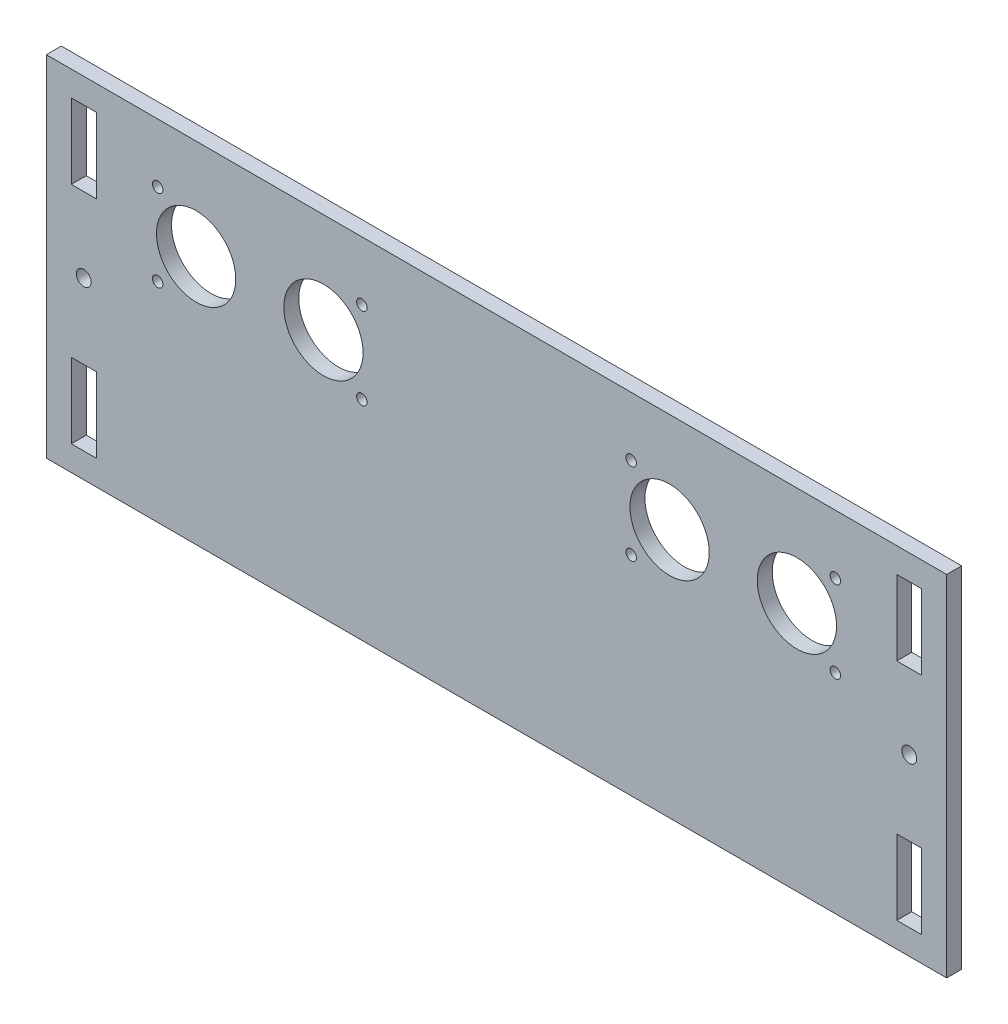
ISO-10303-21;
HEADER;
FILE_DESCRIPTION(('STEP AP214'),'2;1');
FILE_NAME('part.step','',(''),(''),'','','');
FILE_SCHEMA(('AUTOMOTIVE_DESIGN { 1 0 10303 214 1 1 1 1 }'));
ENDSEC;
DATA;
#1=APPLICATION_CONTEXT('core data for automotive mechanical design processes');
#2=APPLICATION_PROTOCOL_DEFINITION('international standard','automotive_design',2000,#1);
#3=PRODUCT_CONTEXT('',#1,'mechanical');
#4=PRODUCT('Part','Part','',(#3));
#5=PRODUCT_RELATED_PRODUCT_CATEGORY('part','',(#4));
#6=PRODUCT_DEFINITION_FORMATION('','',#4);
#7=PRODUCT_DEFINITION_CONTEXT('part definition',#1,'design');
#8=PRODUCT_DEFINITION('design','',#6,#7);
#9=PRODUCT_DEFINITION_SHAPE('','',#8);
#10=(LENGTH_UNIT() NAMED_UNIT(*) SI_UNIT(.MILLI.,.METRE.));
#11=(NAMED_UNIT(*) PLANE_ANGLE_UNIT() SI_UNIT($,.RADIAN.));
#12=(NAMED_UNIT(*) SI_UNIT($,.STERADIAN.) SOLID_ANGLE_UNIT());
#13=UNCERTAINTY_MEASURE_WITH_UNIT(LENGTH_MEASURE(1.E-05),#10,'distance_accuracy_value','');
#14=(GEOMETRIC_REPRESENTATION_CONTEXT(3) GLOBAL_UNCERTAINTY_ASSIGNED_CONTEXT((#13)) GLOBAL_UNIT_ASSIGNED_CONTEXT((#10,
#11,#12)) REPRESENTATION_CONTEXT('',''));
#15=CARTESIAN_POINT('',(0.,0.,0.));
#16=DIRECTION('',(0.,0.,1.));
#17=DIRECTION('',(1.,0.,0.));
#18=AXIS2_PLACEMENT_3D('',#15,#16,#17);
#19=CARTESIAN_POINT('',(0.,0.,3.));
#20=DIRECTION('',(0.,0.,1.));
#21=DIRECTION('',(1.,0.,0.));
#22=AXIS2_PLACEMENT_3D('',#19,#20,#21);
#23=PLANE('',#22);
#24=CARTESIAN_POINT('',(67.87,23.2,3.));
#25=DIRECTION('',(0.,0.,1.));
#26=DIRECTION('',(-1.,0.,0.));
#27=AXIS2_PLACEMENT_3D('',#24,#25,#26);
#28=CIRCLE('',#27,1.04999999999999);
#29=CARTESIAN_POINT('',(66.82,23.2,3.));
#30=VERTEX_POINT('',#29);
#31=EDGE_CURVE('E678',#30,#30,#28,.T.);
#32=ORIENTED_EDGE('',*,*,#31,.F.);
#33=EDGE_LOOP('',(#32));
#34=FACE_BOUND('',#33,.T.);
#35=CARTESIAN_POINT('',(67.87,6.8,3.));
#36=DIRECTION('',(0.,0.,1.));
#37=DIRECTION('',(1.,0.,0.));
#38=AXIS2_PLACEMENT_3D('',#35,#36,#37);
#39=CIRCLE('',#38,1.04999999999999);
#40=CARTESIAN_POINT('',(68.92,6.8,3.));
#41=VERTEX_POINT('',#40);
#42=EDGE_CURVE('E686',#41,#41,#39,.T.);
#43=ORIENTED_EDGE('',*,*,#42,.F.);
#44=EDGE_LOOP('',(#43));
#45=FACE_BOUND('',#44,.T.);
#46=CARTESIAN_POINT('',(26.97,6.8,3.));
#47=DIRECTION('',(0.,0.,1.));
#48=DIRECTION('',(-1.,0.,0.));
#49=AXIS2_PLACEMENT_3D('',#46,#47,#48);
#50=CIRCLE('',#49,1.05);
#51=CARTESIAN_POINT('',(25.92,6.8,3.));
#52=VERTEX_POINT('',#51);
#53=EDGE_CURVE('E692',#52,#52,#50,.T.);
#54=ORIENTED_EDGE('',*,*,#53,.F.);
#55=EDGE_LOOP('',(#54));
#56=FACE_BOUND('',#55,.T.);
#57=CARTESIAN_POINT('',(26.97,23.2,3.));
#58=DIRECTION('',(0.,0.,1.));
#59=DIRECTION('',(1.,0.,0.));
#60=AXIS2_PLACEMENT_3D('',#57,#58,#59);
#61=CIRCLE('',#60,1.05);
#62=CARTESIAN_POINT('',(28.02,23.2,3.));
#63=VERTEX_POINT('',#62);
#64=EDGE_CURVE('E698',#63,#63,#61,.T.);
#65=ORIENTED_EDGE('',*,*,#64,.F.);
#66=EDGE_LOOP('',(#65));
#67=FACE_BOUND('',#66,.T.);
#68=CARTESIAN_POINT('',(-67.87,23.2,3.));
#69=DIRECTION('',(0.,0.,1.));
#70=DIRECTION('',(1.,0.,0.));
#71=AXIS2_PLACEMENT_3D('',#68,#69,#70);
#72=CIRCLE('',#71,1.04999999999999);
#73=CARTESIAN_POINT('',(-66.82,23.2,3.));
#74=VERTEX_POINT('',#73);
#75=EDGE_CURVE('E704',#74,#74,#72,.T.);
#76=ORIENTED_EDGE('',*,*,#75,.F.);
#77=EDGE_LOOP('',(#76));
#78=FACE_BOUND('',#77,.T.);
#79=CARTESIAN_POINT('',(-67.87,6.8,3.));
#80=DIRECTION('',(0.,0.,1.));
#81=DIRECTION('',(-1.,0.,0.));
#82=AXIS2_PLACEMENT_3D('',#79,#80,#81);
#83=CIRCLE('',#82,1.04999999999999);
#84=CARTESIAN_POINT('',(-68.92,6.8,3.));
#85=VERTEX_POINT('',#84);
#86=EDGE_CURVE('E710',#85,#85,#83,.T.);
#87=ORIENTED_EDGE('',*,*,#86,.F.);
#88=EDGE_LOOP('',(#87));
#89=FACE_BOUND('',#88,.T.);
#90=CARTESIAN_POINT('',(-26.97,23.2,3.));
#91=DIRECTION('',(0.,0.,1.));
#92=DIRECTION('',(-1.,0.,0.));
#93=AXIS2_PLACEMENT_3D('',#90,#91,#92);
#94=CIRCLE('',#93,1.05);
#95=CARTESIAN_POINT('',(-28.02,23.2,3.));
#96=VERTEX_POINT('',#95);
#97=EDGE_CURVE('E716',#96,#96,#94,.T.);
#98=ORIENTED_EDGE('',*,*,#97,.F.);
#99=EDGE_LOOP('',(#98));
#100=FACE_BOUND('',#99,.T.);
#101=CARTESIAN_POINT('',(-26.97,6.8,3.));
#102=DIRECTION('',(0.,0.,1.));
#103=DIRECTION('',(1.,0.,0.));
#104=AXIS2_PLACEMENT_3D('',#101,#102,#103);
#105=CIRCLE('',#104,1.05);
#106=CARTESIAN_POINT('',(-25.92,6.8,3.));
#107=VERTEX_POINT('',#106);
#108=EDGE_CURVE('E722',#107,#107,#105,.T.);
#109=ORIENTED_EDGE('',*,*,#108,.F.);
#110=EDGE_LOOP('',(#109));
#111=FACE_BOUND('',#110,.T.);
#112=CARTESIAN_POINT('',(34.67,15.,3.));
#113=DIRECTION('',(0.,0.,1.));
#114=DIRECTION('',(-1.,0.,0.));
#115=AXIS2_PLACEMENT_3D('',#112,#113,#114);
#116=CIRCLE('',#115,7.94);
#117=CARTESIAN_POINT('',(26.73,15.,3.));
#118=VERTEX_POINT('',#117);
#119=EDGE_CURVE('E728',#118,#118,#116,.T.);
#120=ORIENTED_EDGE('',*,*,#119,.F.);
#121=EDGE_LOOP('',(#120));
#122=FACE_BOUND('',#121,.T.);
#123=CARTESIAN_POINT('',(60.17,15.,3.));
#124=DIRECTION('',(0.,0.,1.));
#125=DIRECTION('',(-1.,0.,0.));
#126=AXIS2_PLACEMENT_3D('',#123,#124,#125);
#127=CIRCLE('',#126,7.94);
#128=CARTESIAN_POINT('',(52.23,15.,3.));
#129=VERTEX_POINT('',#128);
#130=EDGE_CURVE('E734',#129,#129,#127,.T.);
#131=ORIENTED_EDGE('',*,*,#130,.F.);
#132=EDGE_LOOP('',(#131));
#133=FACE_BOUND('',#132,.T.);
#134=CARTESIAN_POINT('',(-34.67,15.,3.));
#135=DIRECTION('',(0.,0.,1.));
#136=DIRECTION('',(1.,0.,0.));
#137=AXIS2_PLACEMENT_3D('',#134,#135,#136);
#138=CIRCLE('',#137,7.94);
#139=CARTESIAN_POINT('',(-26.73,15.,3.));
#140=VERTEX_POINT('',#139);
#141=EDGE_CURVE('E740',#140,#140,#138,.T.);
#142=ORIENTED_EDGE('',*,*,#141,.F.);
#143=EDGE_LOOP('',(#142));
#144=FACE_BOUND('',#143,.T.);
#145=CARTESIAN_POINT('',(-60.17,15.,3.));
#146=DIRECTION('',(0.,0.,1.));
#147=DIRECTION('',(1.,0.,0.));
#148=AXIS2_PLACEMENT_3D('',#145,#146,#147);
#149=CIRCLE('',#148,7.94);
#150=CARTESIAN_POINT('',(-52.23,15.,3.));
#151=VERTEX_POINT('',#150);
#152=EDGE_CURVE('E746',#151,#151,#149,.T.);
#153=ORIENTED_EDGE('',*,*,#152,.F.);
#154=EDGE_LOOP('',(#153));
#155=FACE_BOUND('',#154,.T.);
#156=CARTESIAN_POINT('',(82.67,0.,3.));
#157=DIRECTION('',(0.,0.,1.));
#158=DIRECTION('',(-1.,0.,0.));
#159=AXIS2_PLACEMENT_3D('',#156,#157,#158);
#160=CIRCLE('',#159,1.49999999999997);
#161=CARTESIAN_POINT('',(81.17,0.,3.));
#162=VERTEX_POINT('',#161);
#163=EDGE_CURVE('E752',#162,#162,#160,.T.);
#164=ORIENTED_EDGE('',*,*,#163,.F.);
#165=EDGE_LOOP('',(#164));
#166=FACE_BOUND('',#165,.T.);
#167=CARTESIAN_POINT('',(-82.67,0.,3.));
#168=DIRECTION('',(0.,0.,1.));
#169=DIRECTION('',(1.,0.,0.));
#170=AXIS2_PLACEMENT_3D('',#167,#168,#169);
#171=CIRCLE('',#170,1.5);
#172=CARTESIAN_POINT('',(-81.17,0.,3.));
#173=VERTEX_POINT('',#172);
#174=EDGE_CURVE('E200',#173,#173,#171,.T.);
#175=ORIENTED_EDGE('',*,*,#174,.F.);
#176=EDGE_LOOP('',(#175));
#177=FACE_BOUND('',#176,.T.);
#178=DIRECTION('',(0.,-1.,0.));
#179=VECTOR('',#178,1.);
#180=CARTESIAN_POINT('',(-90.17,35.,3.));
#181=LINE('',#180,#179);
#182=CARTESIAN_POINT('',(-90.17,35.,3.));
#183=VERTEX_POINT('',#182);
#184=CARTESIAN_POINT('',(-90.17,-35.,3.));
#185=VERTEX_POINT('',#184);
#186=EDGE_CURVE('E303',#183,#185,#181,.T.);
#187=ORIENTED_EDGE('',*,*,#186,.T.);
#188=DIRECTION('',(1.,0.,0.));
#189=VECTOR('',#188,1.);
#190=CARTESIAN_POINT('',(-90.17,-35.,3.));
#191=LINE('',#190,#189);
#192=CARTESIAN_POINT('',(90.17,-35.,3.));
#193=VERTEX_POINT('',#192);
#194=EDGE_CURVE('E306',#185,#193,#191,.T.);
#195=ORIENTED_EDGE('',*,*,#194,.T.);
#196=DIRECTION('',(0.,1.,0.));
#197=VECTOR('',#196,1.);
#198=CARTESIAN_POINT('',(90.17,35.,3.));
#199=LINE('',#198,#197);
#200=CARTESIAN_POINT('',(90.17,35.,3.));
#201=VERTEX_POINT('',#200);
#202=EDGE_CURVE('E309',#193,#201,#199,.T.);
#203=ORIENTED_EDGE('',*,*,#202,.T.);
#204=DIRECTION('',(-1.,0.,0.));
#205=VECTOR('',#204,1.);
#206=CARTESIAN_POINT('',(-90.17,35.,3.));
#207=LINE('',#206,#205);
#208=EDGE_CURVE('E311',#201,#183,#207,.T.);
#209=ORIENTED_EDGE('',*,*,#208,.T.);
#210=EDGE_LOOP('',(#187,#195,#203,#209));
#211=FACE_BOUND('',#210,.T.);
#212=DIRECTION('',(1.,0.,0.));
#213=VECTOR('',#212,1.);
#214=CARTESIAN_POINT('',(-85.17,15.,3.));
#215=LINE('',#214,#213);
#216=CARTESIAN_POINT('',(-85.17,15.,3.));
#217=VERTEX_POINT('',#216);
#218=CARTESIAN_POINT('',(-80.17,15.,3.));
#219=VERTEX_POINT('',#218);
#220=EDGE_CURVE('E274',#217,#219,#215,.T.);
#221=ORIENTED_EDGE('',*,*,#220,.F.);
#222=DIRECTION('',(0.,-1.,0.));
#223=VECTOR('',#222,1.);
#224=CARTESIAN_POINT('',(-85.17,30.,3.));
#225=LINE('',#224,#223);
#226=CARTESIAN_POINT('',(-85.17,30.,3.));
#227=VERTEX_POINT('',#226);
#228=EDGE_CURVE('E272',#227,#217,#225,.T.);
#229=ORIENTED_EDGE('',*,*,#228,.F.);
#230=DIRECTION('',(-1.,0.,0.));
#231=VECTOR('',#230,1.);
#232=CARTESIAN_POINT('',(-85.17,30.,3.));
#233=LINE('',#232,#231);
#234=CARTESIAN_POINT('',(-80.17,30.,3.));
#235=VERTEX_POINT('',#234);
#236=EDGE_CURVE('E280',#235,#227,#233,.T.);
#237=ORIENTED_EDGE('',*,*,#236,.F.);
#238=DIRECTION('',(0.,1.,0.));
#239=VECTOR('',#238,1.);
#240=CARTESIAN_POINT('',(-80.17,30.,3.));
#241=LINE('',#240,#239);
#242=EDGE_CURVE('E277',#219,#235,#241,.T.);
#243=ORIENTED_EDGE('',*,*,#242,.F.);
#244=EDGE_LOOP('',(#221,#229,#237,#243));
#245=FACE_BOUND('',#244,.T.);
#246=DIRECTION('',(0.,1.,0.));
#247=VECTOR('',#246,1.);
#248=CARTESIAN_POINT('',(-80.17,-30.,3.));
#249=LINE('',#248,#247);
#250=CARTESIAN_POINT('',(-80.17,-30.,3.));
#251=VERTEX_POINT('',#250);
#252=CARTESIAN_POINT('',(-80.17,-15.,3.));
#253=VERTEX_POINT('',#252);
#254=EDGE_CURVE('E243',#251,#253,#249,.T.);
#255=ORIENTED_EDGE('',*,*,#254,.F.);
#256=DIRECTION('',(1.,0.,0.));
#257=VECTOR('',#256,1.);
#258=CARTESIAN_POINT('',(-85.17,-30.,3.));
#259=LINE('',#258,#257);
#260=CARTESIAN_POINT('',(-85.17,-30.,3.));
#261=VERTEX_POINT('',#260);
#262=EDGE_CURVE('E241',#261,#251,#259,.T.);
#263=ORIENTED_EDGE('',*,*,#262,.F.);
#264=DIRECTION('',(0.,-1.,0.));
#265=VECTOR('',#264,1.);
#266=CARTESIAN_POINT('',(-85.17,-30.,3.));
#267=LINE('',#266,#265);
#268=CARTESIAN_POINT('',(-85.17,-15.,3.));
#269=VERTEX_POINT('',#268);
#270=EDGE_CURVE('E249',#269,#261,#267,.T.);
#271=ORIENTED_EDGE('',*,*,#270,.F.);
#272=DIRECTION('',(-1.,0.,0.));
#273=VECTOR('',#272,1.);
#274=CARTESIAN_POINT('',(-85.17,-15.,3.));
#275=LINE('',#274,#273);
#276=EDGE_CURVE('E246',#253,#269,#275,.T.);
#277=ORIENTED_EDGE('',*,*,#276,.F.);
#278=EDGE_LOOP('',(#255,#263,#271,#277));
#279=FACE_BOUND('',#278,.T.);
#280=DIRECTION('',(0.,-1.,0.));
#281=VECTOR('',#280,1.);
#282=CARTESIAN_POINT('',(80.17,30.,3.));
#283=LINE('',#282,#281);
#284=CARTESIAN_POINT('',(80.17,30.,3.));
#285=VERTEX_POINT('',#284);
#286=CARTESIAN_POINT('',(80.17,15.,3.));
#287=VERTEX_POINT('',#286);
#288=EDGE_CURVE('E212',#285,#287,#283,.T.);
#289=ORIENTED_EDGE('',*,*,#288,.F.);
#290=DIRECTION('',(-1.,0.,0.));
#291=VECTOR('',#290,1.);
#292=CARTESIAN_POINT('',(85.17,30.,3.));
#293=LINE('',#292,#291);
#294=CARTESIAN_POINT('',(85.17,30.,3.));
#295=VERTEX_POINT('',#294);
#296=EDGE_CURVE('E210',#295,#285,#293,.T.);
#297=ORIENTED_EDGE('',*,*,#296,.F.);
#298=DIRECTION('',(0.,1.,0.));
#299=VECTOR('',#298,1.);
#300=CARTESIAN_POINT('',(85.17,30.,3.));
#301=LINE('',#300,#299);
#302=CARTESIAN_POINT('',(85.17,15.,3.));
#303=VERTEX_POINT('',#302);
#304=EDGE_CURVE('E218',#303,#295,#301,.T.);
#305=ORIENTED_EDGE('',*,*,#304,.F.);
#306=DIRECTION('',(1.,0.,0.));
#307=VECTOR('',#306,1.);
#308=CARTESIAN_POINT('',(85.17,15.,3.));
#309=LINE('',#308,#307);
#310=EDGE_CURVE('E215',#287,#303,#309,.T.);
#311=ORIENTED_EDGE('',*,*,#310,.F.);
#312=EDGE_LOOP('',(#289,#297,#305,#311));
#313=FACE_BOUND('',#312,.T.);
#314=DIRECTION('',(0.,1.,0.));
#315=VECTOR('',#314,1.);
#316=CARTESIAN_POINT('',(85.17,-30.,3.));
#317=LINE('',#316,#315);
#318=CARTESIAN_POINT('',(85.17,-30.,3.));
#319=VERTEX_POINT('',#318);
#320=CARTESIAN_POINT('',(85.17,-15.,3.));
#321=VERTEX_POINT('',#320);
#322=EDGE_CURVE('E180',#319,#321,#317,.T.);
#323=ORIENTED_EDGE('',*,*,#322,.F.);
#324=DIRECTION('',(1.,0.,0.));
#325=VECTOR('',#324,1.);
#326=CARTESIAN_POINT('',(85.17,-30.,3.));
#327=LINE('',#326,#325);
#328=CARTESIAN_POINT('',(80.17,-30.,3.));
#329=VERTEX_POINT('',#328);
#330=EDGE_CURVE('E172',#329,#319,#327,.T.);
#331=ORIENTED_EDGE('',*,*,#330,.F.);
#332=DIRECTION('',(0.,-1.,0.));
#333=VECTOR('',#332,1.);
#334=CARTESIAN_POINT('',(80.17,-30.,3.));
#335=LINE('',#334,#333);
#336=CARTESIAN_POINT('',(80.17,-15.,3.));
#337=VERTEX_POINT('',#336);
#338=EDGE_CURVE('E194',#337,#329,#335,.T.);
#339=ORIENTED_EDGE('',*,*,#338,.F.);
#340=DIRECTION('',(-1.,0.,0.));
#341=VECTOR('',#340,1.);
#342=CARTESIAN_POINT('',(85.17,-15.,3.));
#343=LINE('',#342,#341);
#344=EDGE_CURVE('E192',#321,#337,#343,.T.);
#345=ORIENTED_EDGE('',*,*,#344,.F.);
#346=EDGE_LOOP('',(#323,#331,#339,#345));
#347=FACE_BOUND('',#346,.T.);
#348=ADVANCED_FACE('F35',(#34,#45,#56,#67,#78,#89,#100,#111,#122,#133,#144,#155,#166,#177,#211,
#245,#279,#313,#347),#23,.T.);
#349=CARTESIAN_POINT('',(0.,0.,0.));
#350=DIRECTION('',(0.,0.,1.));
#351=DIRECTION('',(1.,0.,0.));
#352=AXIS2_PLACEMENT_3D('',#349,#350,#351);
#353=PLANE('',#352);
#354=CARTESIAN_POINT('',(67.87,23.2,0.));
#355=DIRECTION('',(0.,0.,1.));
#356=DIRECTION('',(-1.,0.,0.));
#357=AXIS2_PLACEMENT_3D('',#354,#355,#356);
#358=CIRCLE('',#357,1.04999999999999);
#359=CARTESIAN_POINT('',(66.82,23.2,0.));
#360=VERTEX_POINT('',#359);
#361=EDGE_CURVE('E681',#360,#360,#358,.T.);
#362=ORIENTED_EDGE('',*,*,#361,.T.);
#363=EDGE_LOOP('',(#362));
#364=FACE_BOUND('',#363,.T.);
#365=CARTESIAN_POINT('',(67.87,6.8,0.));
#366=DIRECTION('',(0.,0.,1.));
#367=DIRECTION('',(1.,0.,0.));
#368=AXIS2_PLACEMENT_3D('',#365,#366,#367);
#369=CIRCLE('',#368,1.04999999999999);
#370=CARTESIAN_POINT('',(68.92,6.8,0.));
#371=VERTEX_POINT('',#370);
#372=EDGE_CURVE('E683',#371,#371,#369,.T.);
#373=ORIENTED_EDGE('',*,*,#372,.T.);
#374=EDGE_LOOP('',(#373));
#375=FACE_BOUND('',#374,.T.);
#376=CARTESIAN_POINT('',(26.97,6.8,0.));
#377=DIRECTION('',(0.,0.,1.));
#378=DIRECTION('',(-1.,0.,0.));
#379=AXIS2_PLACEMENT_3D('',#376,#377,#378);
#380=CIRCLE('',#379,1.05);
#381=CARTESIAN_POINT('',(25.92,6.8,0.));
#382=VERTEX_POINT('',#381);
#383=EDGE_CURVE('E689',#382,#382,#380,.T.);
#384=ORIENTED_EDGE('',*,*,#383,.T.);
#385=EDGE_LOOP('',(#384));
#386=FACE_BOUND('',#385,.T.);
#387=CARTESIAN_POINT('',(26.97,23.2,0.));
#388=DIRECTION('',(0.,0.,1.));
#389=DIRECTION('',(1.,0.,0.));
#390=AXIS2_PLACEMENT_3D('',#387,#388,#389);
#391=CIRCLE('',#390,1.05);
#392=CARTESIAN_POINT('',(28.02,23.2,0.));
#393=VERTEX_POINT('',#392);
#394=EDGE_CURVE('E695',#393,#393,#391,.T.);
#395=ORIENTED_EDGE('',*,*,#394,.T.);
#396=EDGE_LOOP('',(#395));
#397=FACE_BOUND('',#396,.T.);
#398=CARTESIAN_POINT('',(-67.87,23.2,0.));
#399=DIRECTION('',(0.,0.,1.));
#400=DIRECTION('',(1.,0.,0.));
#401=AXIS2_PLACEMENT_3D('',#398,#399,#400);
#402=CIRCLE('',#401,1.04999999999999);
#403=CARTESIAN_POINT('',(-66.82,23.2,0.));
#404=VERTEX_POINT('',#403);
#405=EDGE_CURVE('E701',#404,#404,#402,.T.);
#406=ORIENTED_EDGE('',*,*,#405,.T.);
#407=EDGE_LOOP('',(#406));
#408=FACE_BOUND('',#407,.T.);
#409=CARTESIAN_POINT('',(-67.87,6.8,0.));
#410=DIRECTION('',(0.,0.,1.));
#411=DIRECTION('',(-1.,0.,0.));
#412=AXIS2_PLACEMENT_3D('',#409,#410,#411);
#413=CIRCLE('',#412,1.04999999999999);
#414=CARTESIAN_POINT('',(-68.92,6.8,0.));
#415=VERTEX_POINT('',#414);
#416=EDGE_CURVE('E707',#415,#415,#413,.T.);
#417=ORIENTED_EDGE('',*,*,#416,.T.);
#418=EDGE_LOOP('',(#417));
#419=FACE_BOUND('',#418,.T.);
#420=CARTESIAN_POINT('',(-26.97,23.2,0.));
#421=DIRECTION('',(0.,0.,1.));
#422=DIRECTION('',(-1.,0.,0.));
#423=AXIS2_PLACEMENT_3D('',#420,#421,#422);
#424=CIRCLE('',#423,1.05);
#425=CARTESIAN_POINT('',(-28.02,23.2,0.));
#426=VERTEX_POINT('',#425);
#427=EDGE_CURVE('E713',#426,#426,#424,.T.);
#428=ORIENTED_EDGE('',*,*,#427,.T.);
#429=EDGE_LOOP('',(#428));
#430=FACE_BOUND('',#429,.T.);
#431=CARTESIAN_POINT('',(-26.97,6.8,0.));
#432=DIRECTION('',(0.,0.,1.));
#433=DIRECTION('',(1.,0.,0.));
#434=AXIS2_PLACEMENT_3D('',#431,#432,#433);
#435=CIRCLE('',#434,1.05);
#436=CARTESIAN_POINT('',(-25.92,6.8,0.));
#437=VERTEX_POINT('',#436);
#438=EDGE_CURVE('E719',#437,#437,#435,.T.);
#439=ORIENTED_EDGE('',*,*,#438,.T.);
#440=EDGE_LOOP('',(#439));
#441=FACE_BOUND('',#440,.T.);
#442=CARTESIAN_POINT('',(34.67,15.,0.));
#443=DIRECTION('',(0.,0.,1.));
#444=DIRECTION('',(-1.,0.,0.));
#445=AXIS2_PLACEMENT_3D('',#442,#443,#444);
#446=CIRCLE('',#445,7.94);
#447=CARTESIAN_POINT('',(26.73,15.,0.));
#448=VERTEX_POINT('',#447);
#449=EDGE_CURVE('E725',#448,#448,#446,.T.);
#450=ORIENTED_EDGE('',*,*,#449,.T.);
#451=EDGE_LOOP('',(#450));
#452=FACE_BOUND('',#451,.T.);
#453=CARTESIAN_POINT('',(60.17,15.,0.));
#454=DIRECTION('',(0.,0.,1.));
#455=DIRECTION('',(-1.,0.,0.));
#456=AXIS2_PLACEMENT_3D('',#453,#454,#455);
#457=CIRCLE('',#456,7.94);
#458=CARTESIAN_POINT('',(52.23,15.,0.));
#459=VERTEX_POINT('',#458);
#460=EDGE_CURVE('E731',#459,#459,#457,.T.);
#461=ORIENTED_EDGE('',*,*,#460,.T.);
#462=EDGE_LOOP('',(#461));
#463=FACE_BOUND('',#462,.T.);
#464=CARTESIAN_POINT('',(-34.67,15.,0.));
#465=DIRECTION('',(0.,0.,1.));
#466=DIRECTION('',(1.,0.,0.));
#467=AXIS2_PLACEMENT_3D('',#464,#465,#466);
#468=CIRCLE('',#467,7.94);
#469=CARTESIAN_POINT('',(-26.73,15.,0.));
#470=VERTEX_POINT('',#469);
#471=EDGE_CURVE('E737',#470,#470,#468,.T.);
#472=ORIENTED_EDGE('',*,*,#471,.T.);
#473=EDGE_LOOP('',(#472));
#474=FACE_BOUND('',#473,.T.);
#475=CARTESIAN_POINT('',(-60.17,15.,0.));
#476=DIRECTION('',(0.,0.,1.));
#477=DIRECTION('',(1.,0.,0.));
#478=AXIS2_PLACEMENT_3D('',#475,#476,#477);
#479=CIRCLE('',#478,7.94);
#480=CARTESIAN_POINT('',(-52.23,15.,0.));
#481=VERTEX_POINT('',#480);
#482=EDGE_CURVE('E743',#481,#481,#479,.T.);
#483=ORIENTED_EDGE('',*,*,#482,.T.);
#484=EDGE_LOOP('',(#483));
#485=FACE_BOUND('',#484,.T.);
#486=CARTESIAN_POINT('',(82.67,0.,0.));
#487=DIRECTION('',(0.,0.,1.));
#488=DIRECTION('',(-1.,0.,0.));
#489=AXIS2_PLACEMENT_3D('',#486,#487,#488);
#490=CIRCLE('',#489,1.49999999999997);
#491=CARTESIAN_POINT('',(81.17,0.,0.));
#492=VERTEX_POINT('',#491);
#493=EDGE_CURVE('E749',#492,#492,#490,.T.);
#494=ORIENTED_EDGE('',*,*,#493,.T.);
#495=EDGE_LOOP('',(#494));
#496=FACE_BOUND('',#495,.T.);
#497=CARTESIAN_POINT('',(-82.67,0.,0.));
#498=DIRECTION('',(0.,0.,1.));
#499=DIRECTION('',(1.,0.,0.));
#500=AXIS2_PLACEMENT_3D('',#497,#498,#499);
#501=CIRCLE('',#500,1.5);
#502=CARTESIAN_POINT('',(-81.17,0.,0.));
#503=VERTEX_POINT('',#502);
#504=EDGE_CURVE('E755',#503,#503,#501,.T.);
#505=ORIENTED_EDGE('',*,*,#504,.T.);
#506=EDGE_LOOP('',(#505));
#507=FACE_BOUND('',#506,.T.);
#508=DIRECTION('',(-1.,0.,0.));
#509=VECTOR('',#508,1.);
#510=CARTESIAN_POINT('',(85.17,30.,0.));
#511=LINE('',#510,#509);
#512=CARTESIAN_POINT('',(85.17,30.,0.));
#513=VERTEX_POINT('',#512);
#514=CARTESIAN_POINT('',(80.17,30.,0.));
#515=VERTEX_POINT('',#514);
#516=EDGE_CURVE('E188',#513,#515,#511,.T.);
#517=ORIENTED_EDGE('',*,*,#516,.T.);
#518=DIRECTION('',(0.,-1.,0.));
#519=VECTOR('',#518,1.);
#520=CARTESIAN_POINT('',(80.17,30.,0.));
#521=LINE('',#520,#519);
#522=CARTESIAN_POINT('',(80.17,15.,0.));
#523=VERTEX_POINT('',#522);
#524=EDGE_CURVE('E223',#515,#523,#521,.T.);
#525=ORIENTED_EDGE('',*,*,#524,.T.);
#526=DIRECTION('',(1.,0.,0.));
#527=VECTOR('',#526,1.);
#528=CARTESIAN_POINT('',(85.17,15.,0.));
#529=LINE('',#528,#527);
#530=CARTESIAN_POINT('',(85.17,15.,0.));
#531=VERTEX_POINT('',#530);
#532=EDGE_CURVE('E226',#523,#531,#529,.T.);
#533=ORIENTED_EDGE('',*,*,#532,.T.);
#534=DIRECTION('',(0.,1.,0.));
#535=VECTOR('',#534,1.);
#536=CARTESIAN_POINT('',(85.17,30.,0.));
#537=LINE('',#536,#535);
#538=EDGE_CURVE('E213',#531,#513,#537,.T.);
#539=ORIENTED_EDGE('',*,*,#538,.T.);
#540=EDGE_LOOP('',(#517,#525,#533,#539));
#541=FACE_BOUND('',#540,.T.);
#542=DIRECTION('',(0.,-1.,0.));
#543=VECTOR('',#542,1.);
#544=CARTESIAN_POINT('',(-85.17,30.,0.));
#545=LINE('',#544,#543);
#546=CARTESIAN_POINT('',(-85.17,30.,0.));
#547=VERTEX_POINT('',#546);
#548=CARTESIAN_POINT('',(-85.17,15.,0.));
#549=VERTEX_POINT('',#548);
#550=EDGE_CURVE('E271',#547,#549,#545,.T.);
#551=ORIENTED_EDGE('',*,*,#550,.T.);
#552=DIRECTION('',(1.,0.,0.));
#553=VECTOR('',#552,1.);
#554=CARTESIAN_POINT('',(-85.17,15.,0.));
#555=LINE('',#554,#553);
#556=CARTESIAN_POINT('',(-80.17,15.,0.));
#557=VERTEX_POINT('',#556);
#558=EDGE_CURVE('E285',#549,#557,#555,.T.);
#559=ORIENTED_EDGE('',*,*,#558,.T.);
#560=DIRECTION('',(0.,1.,0.));
#561=VECTOR('',#560,1.);
#562=CARTESIAN_POINT('',(-80.17,30.,0.));
#563=LINE('',#562,#561);
#564=CARTESIAN_POINT('',(-80.17,30.,0.));
#565=VERTEX_POINT('',#564);
#566=EDGE_CURVE('E288',#557,#565,#563,.T.);
#567=ORIENTED_EDGE('',*,*,#566,.T.);
#568=DIRECTION('',(-1.,0.,0.));
#569=VECTOR('',#568,1.);
#570=CARTESIAN_POINT('',(-85.17,30.,0.));
#571=LINE('',#570,#569);
#572=EDGE_CURVE('E275',#565,#547,#571,.T.);
#573=ORIENTED_EDGE('',*,*,#572,.T.);
#574=EDGE_LOOP('',(#551,#559,#567,#573));
#575=FACE_BOUND('',#574,.T.);
#576=DIRECTION('',(0.,-1.,0.));
#577=VECTOR('',#576,1.);
#578=CARTESIAN_POINT('',(-90.17,35.,0.));
#579=LINE('',#578,#577);
#580=CARTESIAN_POINT('',(-90.17,35.,0.));
#581=VERTEX_POINT('',#580);
#582=CARTESIAN_POINT('',(-90.17,-35.,0.));
#583=VERTEX_POINT('',#582);
#584=EDGE_CURVE('E302',#581,#583,#579,.T.);
#585=ORIENTED_EDGE('',*,*,#584,.F.);
#586=DIRECTION('',(-1.,0.,0.));
#587=VECTOR('',#586,1.);
#588=CARTESIAN_POINT('',(-90.17,35.,0.));
#589=LINE('',#588,#587);
#590=CARTESIAN_POINT('',(90.17,35.,0.));
#591=VERTEX_POINT('',#590);
#592=EDGE_CURVE('E307',#591,#581,#589,.T.);
#593=ORIENTED_EDGE('',*,*,#592,.F.);
#594=DIRECTION('',(0.,1.,0.));
#595=VECTOR('',#594,1.);
#596=CARTESIAN_POINT('',(90.17,35.,0.));
#597=LINE('',#596,#595);
#598=CARTESIAN_POINT('',(90.17,-35.,0.));
#599=VERTEX_POINT('',#598);
#600=EDGE_CURVE('E318',#599,#591,#597,.T.);
#601=ORIENTED_EDGE('',*,*,#600,.F.);
#602=DIRECTION('',(1.,0.,0.));
#603=VECTOR('',#602,1.);
#604=CARTESIAN_POINT('',(-90.17,-35.,0.));
#605=LINE('',#604,#603);
#606=EDGE_CURVE('E316',#583,#599,#605,.T.);
#607=ORIENTED_EDGE('',*,*,#606,.F.);
#608=EDGE_LOOP('',(#585,#593,#601,#607));
#609=FACE_BOUND('',#608,.T.);
#610=DIRECTION('',(1.,0.,0.));
#611=VECTOR('',#610,1.);
#612=CARTESIAN_POINT('',(-85.17,-30.,0.));
#613=LINE('',#612,#611);
#614=CARTESIAN_POINT('',(-85.17,-30.,0.));
#615=VERTEX_POINT('',#614);
#616=CARTESIAN_POINT('',(-80.17,-30.,0.));
#617=VERTEX_POINT('',#616);
#618=EDGE_CURVE('E240',#615,#617,#613,.T.);
#619=ORIENTED_EDGE('',*,*,#618,.T.);
#620=DIRECTION('',(0.,1.,0.));
#621=VECTOR('',#620,1.);
#622=CARTESIAN_POINT('',(-80.17,-30.,0.));
#623=LINE('',#622,#621);
#624=CARTESIAN_POINT('',(-80.17,-15.,0.));
#625=VERTEX_POINT('',#624);
#626=EDGE_CURVE('E254',#617,#625,#623,.T.);
#627=ORIENTED_EDGE('',*,*,#626,.T.);
#628=DIRECTION('',(-1.,0.,0.));
#629=VECTOR('',#628,1.);
#630=CARTESIAN_POINT('',(-85.17,-15.,0.));
#631=LINE('',#630,#629);
#632=CARTESIAN_POINT('',(-85.17,-15.,0.));
#633=VERTEX_POINT('',#632);
#634=EDGE_CURVE('E257',#625,#633,#631,.T.);
#635=ORIENTED_EDGE('',*,*,#634,.T.);
#636=DIRECTION('',(0.,-1.,0.));
#637=VECTOR('',#636,1.);
#638=CARTESIAN_POINT('',(-85.17,-30.,0.));
#639=LINE('',#638,#637);
#640=EDGE_CURVE('E244',#633,#615,#639,.T.);
#641=ORIENTED_EDGE('',*,*,#640,.T.);
#642=EDGE_LOOP('',(#619,#627,#635,#641));
#643=FACE_BOUND('',#642,.T.);
#644=DIRECTION('',(1.,0.,0.));
#645=VECTOR('',#644,1.);
#646=CARTESIAN_POINT('',(85.17,-30.,0.));
#647=LINE('',#646,#645);
#648=CARTESIAN_POINT('',(80.17,-30.,0.));
#649=VERTEX_POINT('',#648);
#650=CARTESIAN_POINT('',(85.17,-30.,0.));
#651=VERTEX_POINT('',#650);
#652=EDGE_CURVE('E58',#649,#651,#647,.T.);
#653=ORIENTED_EDGE('',*,*,#652,.T.);
#654=DIRECTION('',(0.,1.,0.));
#655=VECTOR('',#654,1.);
#656=CARTESIAN_POINT('',(85.17,-30.,0.));
#657=LINE('',#656,#655);
#658=CARTESIAN_POINT('',(85.17,-15.,0.));
#659=VERTEX_POINT('',#658);
#660=EDGE_CURVE('E187',#651,#659,#657,.T.);
#661=ORIENTED_EDGE('',*,*,#660,.T.);
#662=DIRECTION('',(-1.,0.,0.));
#663=VECTOR('',#662,1.);
#664=CARTESIAN_POINT('',(85.17,-15.,0.));
#665=LINE('',#664,#663);
#666=CARTESIAN_POINT('',(80.17,-15.,0.));
#667=VERTEX_POINT('',#666);
#668=EDGE_CURVE('E202',#659,#667,#665,.T.);
#669=ORIENTED_EDGE('',*,*,#668,.T.);
#670=DIRECTION('',(0.,-1.,0.));
#671=VECTOR('',#670,1.);
#672=CARTESIAN_POINT('',(80.17,-30.,0.));
#673=LINE('',#672,#671);
#674=EDGE_CURVE('E181',#667,#649,#673,.T.);
#675=ORIENTED_EDGE('',*,*,#674,.T.);
#676=EDGE_LOOP('',(#653,#661,#669,#675));
#677=FACE_BOUND('',#676,.T.);
#678=ADVANCED_FACE('F336',(#364,#375,#386,#397,#408,#419,#430,#441,#452,#463,#474,#485,#496,
#507,#541,#575,#609,#643,#677),#353,.F.);
#679=CARTESIAN_POINT('',(-90.17,35.,3.));
#680=DIRECTION('',(1.,0.,0.));
#681=DIRECTION('',(0.,0.,-1.));
#682=AXIS2_PLACEMENT_3D('',#679,#680,#681);
#683=PLANE('',#682);
#684=ORIENTED_EDGE('',*,*,#584,.T.);
#685=DIRECTION('',(0.,0.,-1.));
#686=VECTOR('',#685,1.);
#687=CARTESIAN_POINT('',(-90.17,-35.,3.));
#688=LINE('',#687,#686);
#689=EDGE_CURVE('E11',#185,#583,#688,.T.);
#690=ORIENTED_EDGE('',*,*,#689,.F.);
#691=ORIENTED_EDGE('',*,*,#186,.F.);
#692=DIRECTION('',(0.,0.,-1.));
#693=VECTOR('',#692,1.);
#694=CARTESIAN_POINT('',(-90.17,35.,3.));
#695=LINE('',#694,#693);
#696=EDGE_CURVE('E313',#183,#581,#695,.T.);
#697=ORIENTED_EDGE('',*,*,#696,.T.);
#698=EDGE_LOOP('',(#684,#690,#691,#697));
#699=FACE_BOUND('',#698,.T.);
#700=ADVANCED_FACE('F37',(#699),#683,.F.);
#701=CARTESIAN_POINT('',(-90.17,-35.,3.));
#702=DIRECTION('',(0.,1.,0.));
#703=DIRECTION('',(0.,0.,1.));
#704=AXIS2_PLACEMENT_3D('',#701,#702,#703);
#705=PLANE('',#704);
#706=ORIENTED_EDGE('',*,*,#606,.T.);
#707=DIRECTION('',(0.,0.,-1.));
#708=VECTOR('',#707,1.);
#709=CARTESIAN_POINT('',(90.17,-35.,3.));
#710=LINE('',#709,#708);
#711=EDGE_CURVE('E43',#193,#599,#710,.T.);
#712=ORIENTED_EDGE('',*,*,#711,.F.);
#713=ORIENTED_EDGE('',*,*,#194,.F.);
#714=ORIENTED_EDGE('',*,*,#689,.T.);
#715=EDGE_LOOP('',(#706,#712,#713,#714));
#716=FACE_BOUND('',#715,.T.);
#717=ADVANCED_FACE('F347',(#716),#705,.F.);
#718=CARTESIAN_POINT('',(90.17,35.,3.));
#719=DIRECTION('',(-1.,0.,0.));
#720=DIRECTION('',(0.,0.,1.));
#721=AXIS2_PLACEMENT_3D('',#718,#719,#720);
#722=PLANE('',#721);
#723=ORIENTED_EDGE('',*,*,#600,.T.);
#724=DIRECTION('',(0.,0.,-1.));
#725=VECTOR('',#724,1.);
#726=CARTESIAN_POINT('',(90.17,35.,3.));
#727=LINE('',#726,#725);
#728=EDGE_CURVE('E323',#201,#591,#727,.T.);
#729=ORIENTED_EDGE('',*,*,#728,.F.);
#730=ORIENTED_EDGE('',*,*,#202,.F.);
#731=ORIENTED_EDGE('',*,*,#711,.T.);
#732=EDGE_LOOP('',(#723,#729,#730,#731));
#733=FACE_BOUND('',#732,.T.);
#734=ADVANCED_FACE('F330',(#733),#722,.F.);
#735=CARTESIAN_POINT('',(-90.17,35.,3.));
#736=DIRECTION('',(0.,-1.,0.));
#737=DIRECTION('',(0.,0.,-1.));
#738=AXIS2_PLACEMENT_3D('',#735,#736,#737);
#739=PLANE('',#738);
#740=ORIENTED_EDGE('',*,*,#592,.T.);
#741=ORIENTED_EDGE('',*,*,#696,.F.);
#742=ORIENTED_EDGE('',*,*,#208,.F.);
#743=ORIENTED_EDGE('',*,*,#728,.T.);
#744=EDGE_LOOP('',(#740,#741,#742,#743));
#745=FACE_BOUND('',#744,.T.);
#746=ADVANCED_FACE('F340',(#745),#739,.F.);
#747=CARTESIAN_POINT('',(-85.17,30.,3.));
#748=DIRECTION('',(1.,0.,0.));
#749=DIRECTION('',(0.,0.,-1.));
#750=AXIS2_PLACEMENT_3D('',#747,#748,#749);
#751=PLANE('',#750);
#752=ORIENTED_EDGE('',*,*,#550,.F.);
#753=DIRECTION('',(0.,0.,-1.));
#754=VECTOR('',#753,1.);
#755=CARTESIAN_POINT('',(-85.17,30.,3.));
#756=LINE('',#755,#754);
#757=EDGE_CURVE('E282',#227,#547,#756,.T.);
#758=ORIENTED_EDGE('',*,*,#757,.F.);
#759=ORIENTED_EDGE('',*,*,#228,.T.);
#760=DIRECTION('',(0.,0.,-1.));
#761=VECTOR('',#760,1.);
#762=CARTESIAN_POINT('',(-85.17,15.,3.));
#763=LINE('',#762,#761);
#764=EDGE_CURVE('E299',#217,#549,#763,.T.);
#765=ORIENTED_EDGE('',*,*,#764,.T.);
#766=EDGE_LOOP('',(#752,#758,#759,#765));
#767=FACE_BOUND('',#766,.T.);
#768=ADVANCED_FACE('F365',(#767),#751,.T.);
#769=CARTESIAN_POINT('',(-85.17,15.,3.));
#770=DIRECTION('',(0.,1.,0.));
#771=DIRECTION('',(0.,0.,1.));
#772=AXIS2_PLACEMENT_3D('',#769,#770,#771);
#773=PLANE('',#772);
#774=ORIENTED_EDGE('',*,*,#558,.F.);
#775=ORIENTED_EDGE('',*,*,#764,.F.);
#776=ORIENTED_EDGE('',*,*,#220,.T.);
#777=DIRECTION('',(0.,0.,-1.));
#778=VECTOR('',#777,1.);
#779=CARTESIAN_POINT('',(-80.17,15.,3.));
#780=LINE('',#779,#778);
#781=EDGE_CURVE('E297',#219,#557,#780,.T.);
#782=ORIENTED_EDGE('',*,*,#781,.T.);
#783=EDGE_LOOP('',(#774,#775,#776,#782));
#784=FACE_BOUND('',#783,.T.);
#785=ADVANCED_FACE('F372',(#784),#773,.T.);
#786=CARTESIAN_POINT('',(-80.17,30.,3.));
#787=DIRECTION('',(-1.,0.,0.));
#788=DIRECTION('',(0.,0.,1.));
#789=AXIS2_PLACEMENT_3D('',#786,#787,#788);
#790=PLANE('',#789);
#791=ORIENTED_EDGE('',*,*,#566,.F.);
#792=ORIENTED_EDGE('',*,*,#781,.F.);
#793=ORIENTED_EDGE('',*,*,#242,.T.);
#794=DIRECTION('',(0.,0.,-1.));
#795=VECTOR('',#794,1.);
#796=CARTESIAN_POINT('',(-80.17,30.,3.));
#797=LINE('',#796,#795);
#798=EDGE_CURVE('E295',#235,#565,#797,.T.);
#799=ORIENTED_EDGE('',*,*,#798,.T.);
#800=EDGE_LOOP('',(#791,#792,#793,#799));
#801=FACE_BOUND('',#800,.T.);
#802=ADVANCED_FACE('F377',(#801),#790,.T.);
#803=CARTESIAN_POINT('',(-85.17,30.,3.));
#804=DIRECTION('',(0.,-1.,0.));
#805=DIRECTION('',(0.,0.,-1.));
#806=AXIS2_PLACEMENT_3D('',#803,#804,#805);
#807=PLANE('',#806);
#808=ORIENTED_EDGE('',*,*,#572,.F.);
#809=ORIENTED_EDGE('',*,*,#798,.F.);
#810=ORIENTED_EDGE('',*,*,#236,.T.);
#811=ORIENTED_EDGE('',*,*,#757,.T.);
#812=EDGE_LOOP('',(#808,#809,#810,#811));
#813=FACE_BOUND('',#812,.T.);
#814=ADVANCED_FACE('F385',(#813),#807,.T.);
#815=CARTESIAN_POINT('',(-85.17,-30.,3.));
#816=DIRECTION('',(0.,1.,0.));
#817=DIRECTION('',(0.,0.,1.));
#818=AXIS2_PLACEMENT_3D('',#815,#816,#817);
#819=PLANE('',#818);
#820=ORIENTED_EDGE('',*,*,#618,.F.);
#821=DIRECTION('',(0.,0.,-1.));
#822=VECTOR('',#821,1.);
#823=CARTESIAN_POINT('',(-85.17,-30.,3.));
#824=LINE('',#823,#822);
#825=EDGE_CURVE('E251',#261,#615,#824,.T.);
#826=ORIENTED_EDGE('',*,*,#825,.F.);
#827=ORIENTED_EDGE('',*,*,#262,.T.);
#828=DIRECTION('',(0.,0.,-1.));
#829=VECTOR('',#828,1.);
#830=CARTESIAN_POINT('',(-80.17,-30.,3.));
#831=LINE('',#830,#829);
#832=EDGE_CURVE('E268',#251,#617,#831,.T.);
#833=ORIENTED_EDGE('',*,*,#832,.T.);
#834=EDGE_LOOP('',(#820,#826,#827,#833));
#835=FACE_BOUND('',#834,.T.);
#836=ADVANCED_FACE('F440',(#835),#819,.T.);
#837=CARTESIAN_POINT('',(-80.17,-30.,3.));
#838=DIRECTION('',(-1.,0.,0.));
#839=DIRECTION('',(0.,0.,1.));
#840=AXIS2_PLACEMENT_3D('',#837,#838,#839);
#841=PLANE('',#840);
#842=ORIENTED_EDGE('',*,*,#626,.F.);
#843=ORIENTED_EDGE('',*,*,#832,.F.);
#844=ORIENTED_EDGE('',*,*,#254,.T.);
#845=DIRECTION('',(0.,0.,-1.));
#846=VECTOR('',#845,1.);
#847=CARTESIAN_POINT('',(-80.17,-15.,3.));
#848=LINE('',#847,#846);
#849=EDGE_CURVE('E266',#253,#625,#848,.T.);
#850=ORIENTED_EDGE('',*,*,#849,.T.);
#851=EDGE_LOOP('',(#842,#843,#844,#850));
#852=FACE_BOUND('',#851,.T.);
#853=ADVANCED_FACE('F436',(#852),#841,.T.);
#854=CARTESIAN_POINT('',(-85.17,-15.,3.));
#855=DIRECTION('',(0.,-1.,0.));
#856=DIRECTION('',(0.,0.,-1.));
#857=AXIS2_PLACEMENT_3D('',#854,#855,#856);
#858=PLANE('',#857);
#859=ORIENTED_EDGE('',*,*,#634,.F.);
#860=ORIENTED_EDGE('',*,*,#849,.F.);
#861=ORIENTED_EDGE('',*,*,#276,.T.);
#862=DIRECTION('',(0.,0.,-1.));
#863=VECTOR('',#862,1.);
#864=CARTESIAN_POINT('',(-85.17,-15.,3.));
#865=LINE('',#864,#863);
#866=EDGE_CURVE('E264',#269,#633,#865,.T.);
#867=ORIENTED_EDGE('',*,*,#866,.T.);
#868=EDGE_LOOP('',(#859,#860,#861,#867));
#869=FACE_BOUND('',#868,.T.);
#870=ADVANCED_FACE('F432',(#869),#858,.T.);
#871=CARTESIAN_POINT('',(-85.17,-30.,3.));
#872=DIRECTION('',(1.,0.,0.));
#873=DIRECTION('',(0.,1.,0.));
#874=AXIS2_PLACEMENT_3D('',#871,#872,#873);
#875=PLANE('',#874);
#876=ORIENTED_EDGE('',*,*,#640,.F.);
#877=ORIENTED_EDGE('',*,*,#866,.F.);
#878=ORIENTED_EDGE('',*,*,#270,.T.);
#879=ORIENTED_EDGE('',*,*,#825,.T.);
#880=EDGE_LOOP('',(#876,#877,#878,#879));
#881=FACE_BOUND('',#880,.T.);
#882=ADVANCED_FACE('F429',(#881),#875,.T.);
#883=CARTESIAN_POINT('',(85.17,30.,3.));
#884=DIRECTION('',(0.,-1.,0.));
#885=DIRECTION('',(0.,0.,-1.));
#886=AXIS2_PLACEMENT_3D('',#883,#884,#885);
#887=PLANE('',#886);
#888=ORIENTED_EDGE('',*,*,#516,.F.);
#889=DIRECTION('',(0.,0.,-1.));
#890=VECTOR('',#889,1.);
#891=CARTESIAN_POINT('',(85.17,30.,3.));
#892=LINE('',#891,#890);
#893=EDGE_CURVE('E220',#295,#513,#892,.T.);
#894=ORIENTED_EDGE('',*,*,#893,.F.);
#895=ORIENTED_EDGE('',*,*,#296,.T.);
#896=DIRECTION('',(0.,0.,-1.));
#897=VECTOR('',#896,1.);
#898=CARTESIAN_POINT('',(80.17,30.,3.));
#899=LINE('',#898,#897);
#900=EDGE_CURVE('E237',#285,#515,#899,.T.);
#901=ORIENTED_EDGE('',*,*,#900,.T.);
#902=EDGE_LOOP('',(#888,#894,#895,#901));
#903=FACE_BOUND('',#902,.T.);
#904=ADVANCED_FACE('F411',(#903),#887,.T.);
#905=CARTESIAN_POINT('',(80.17,30.,3.));
#906=DIRECTION('',(1.,0.,0.));
#907=DIRECTION('',(0.,1.,0.));
#908=AXIS2_PLACEMENT_3D('',#905,#906,#907);
#909=PLANE('',#908);
#910=ORIENTED_EDGE('',*,*,#524,.F.);
#911=ORIENTED_EDGE('',*,*,#900,.F.);
#912=ORIENTED_EDGE('',*,*,#288,.T.);
#913=DIRECTION('',(0.,0.,-1.));
#914=VECTOR('',#913,1.);
#915=CARTESIAN_POINT('',(80.17,15.,3.));
#916=LINE('',#915,#914);
#917=EDGE_CURVE('E235',#287,#523,#916,.T.);
#918=ORIENTED_EDGE('',*,*,#917,.T.);
#919=EDGE_LOOP('',(#910,#911,#912,#918));
#920=FACE_BOUND('',#919,.T.);
#921=ADVANCED_FACE('F404',(#920),#909,.T.);
#922=CARTESIAN_POINT('',(85.17,15.,3.));
#923=DIRECTION('',(0.,1.,0.));
#924=DIRECTION('',(-1.,0.,0.));
#925=AXIS2_PLACEMENT_3D('',#922,#923,#924);
#926=PLANE('',#925);
#927=ORIENTED_EDGE('',*,*,#532,.F.);
#928=ORIENTED_EDGE('',*,*,#917,.F.);
#929=ORIENTED_EDGE('',*,*,#310,.T.);
#930=DIRECTION('',(0.,0.,-1.));
#931=VECTOR('',#930,1.);
#932=CARTESIAN_POINT('',(85.17,15.,3.));
#933=LINE('',#932,#931);
#934=EDGE_CURVE('E233',#303,#531,#933,.T.);
#935=ORIENTED_EDGE('',*,*,#934,.T.);
#936=EDGE_LOOP('',(#927,#928,#929,#935));
#937=FACE_BOUND('',#936,.T.);
#938=ADVANCED_FACE('F407',(#937),#926,.T.);
#939=CARTESIAN_POINT('',(85.17,30.,3.));
#940=DIRECTION('',(-1.,0.,0.));
#941=DIRECTION('',(0.,-1.,0.));
#942=AXIS2_PLACEMENT_3D('',#939,#940,#941);
#943=PLANE('',#942);
#944=ORIENTED_EDGE('',*,*,#538,.F.);
#945=ORIENTED_EDGE('',*,*,#934,.F.);
#946=ORIENTED_EDGE('',*,*,#304,.T.);
#947=ORIENTED_EDGE('',*,*,#893,.T.);
#948=EDGE_LOOP('',(#944,#945,#946,#947));
#949=FACE_BOUND('',#948,.T.);
#950=ADVANCED_FACE('F414',(#949),#943,.T.);
#951=CARTESIAN_POINT('',(85.17,-30.,3.));
#952=DIRECTION('',(0.,1.,0.));
#953=DIRECTION('',(0.,0.,1.));
#954=AXIS2_PLACEMENT_3D('',#951,#952,#953);
#955=PLANE('',#954);
#956=ORIENTED_EDGE('',*,*,#652,.F.);
#957=DIRECTION('',(0.,0.,-1.));
#958=VECTOR('',#957,1.);
#959=CARTESIAN_POINT('',(80.17,-30.,3.));
#960=LINE('',#959,#958);
#961=EDGE_CURVE('E176',#329,#649,#960,.T.);
#962=ORIENTED_EDGE('',*,*,#961,.F.);
#963=ORIENTED_EDGE('',*,*,#330,.T.);
#964=DIRECTION('',(0.,0.,-1.));
#965=VECTOR('',#964,1.);
#966=CARTESIAN_POINT('',(85.17,-30.,3.));
#967=LINE('',#966,#965);
#968=EDGE_CURVE('E175',#319,#651,#967,.T.);
#969=ORIENTED_EDGE('',*,*,#968,.T.);
#970=EDGE_LOOP('',(#956,#962,#963,#969));
#971=FACE_BOUND('',#970,.T.);
#972=ADVANCED_FACE('F174',(#971),#955,.T.);
#973=CARTESIAN_POINT('',(85.17,-30.,3.));
#974=DIRECTION('',(-1.,0.,0.));
#975=DIRECTION('',(0.,-1.,0.));
#976=AXIS2_PLACEMENT_3D('',#973,#974,#975);
#977=PLANE('',#976);
#978=ORIENTED_EDGE('',*,*,#660,.F.);
#979=ORIENTED_EDGE('',*,*,#968,.F.);
#980=ORIENTED_EDGE('',*,*,#322,.T.);
#981=DIRECTION('',(0.,0.,-1.));
#982=VECTOR('',#981,1.);
#983=CARTESIAN_POINT('',(85.17,-15.,3.));
#984=LINE('',#983,#982);
#985=EDGE_CURVE('E189',#321,#659,#984,.T.);
#986=ORIENTED_EDGE('',*,*,#985,.T.);
#987=EDGE_LOOP('',(#978,#979,#980,#986));
#988=FACE_BOUND('',#987,.T.);
#989=ADVANCED_FACE('F184',(#988),#977,.T.);
#990=CARTESIAN_POINT('',(85.17,-15.,3.));
#991=DIRECTION('',(0.,-1.,0.));
#992=DIRECTION('',(1.,0.,0.));
#993=AXIS2_PLACEMENT_3D('',#990,#991,#992);
#994=PLANE('',#993);
#995=ORIENTED_EDGE('',*,*,#668,.F.);
#996=ORIENTED_EDGE('',*,*,#985,.F.);
#997=ORIENTED_EDGE('',*,*,#344,.T.);
#998=DIRECTION('',(0.,0.,-1.));
#999=VECTOR('',#998,1.);
#1000=CARTESIAN_POINT('',(80.17,-15.,3.));
#1001=LINE('',#1000,#999);
#1002=EDGE_CURVE('E50',#337,#667,#1001,.T.);
#1003=ORIENTED_EDGE('',*,*,#1002,.T.);
#1004=EDGE_LOOP('',(#995,#996,#997,#1003));
#1005=FACE_BOUND('',#1004,.T.);
#1006=ADVANCED_FACE('F503',(#1005),#994,.T.);
#1007=CARTESIAN_POINT('',(80.17,-30.,3.));
#1008=DIRECTION('',(1.,0.,0.));
#1009=DIRECTION('',(0.,1.,0.));
#1010=AXIS2_PLACEMENT_3D('',#1007,#1008,#1009);
#1011=PLANE('',#1010);
#1012=ORIENTED_EDGE('',*,*,#674,.F.);
#1013=ORIENTED_EDGE('',*,*,#1002,.F.);
#1014=ORIENTED_EDGE('',*,*,#338,.T.);
#1015=ORIENTED_EDGE('',*,*,#961,.T.);
#1016=EDGE_LOOP('',(#1012,#1013,#1014,#1015));
#1017=FACE_BOUND('',#1016,.T.);
#1018=ADVANCED_FACE('F511',(#1017),#1011,.T.);
#1019=CARTESIAN_POINT('',(-82.67,0.,3.));
#1020=DIRECTION('',(0.,0.,-1.));
#1021=DIRECTION('',(-1.,0.,0.));
#1022=AXIS2_PLACEMENT_3D('',#1019,#1020,#1021);
#1023=CYLINDRICAL_SURFACE('',#1022,1.5);
#1024=ORIENTED_EDGE('',*,*,#174,.T.);
#1025=EDGE_LOOP('',(#1024));
#1026=FACE_BOUND('',#1025,.T.);
#1027=ORIENTED_EDGE('',*,*,#504,.F.);
#1028=EDGE_LOOP('',(#1027));
#1029=FACE_BOUND('',#1028,.T.);
#1030=ADVANCED_FACE('F521',(#1026,#1029),#1023,.F.);
#1031=CARTESIAN_POINT('',(82.67,0.,3.));
#1032=DIRECTION('',(0.,0.,-1.));
#1033=DIRECTION('',(-1.,0.,0.));
#1034=AXIS2_PLACEMENT_3D('',#1031,#1032,#1033);
#1035=CYLINDRICAL_SURFACE('',#1034,1.49999999999997);
#1036=ORIENTED_EDGE('',*,*,#163,.T.);
#1037=EDGE_LOOP('',(#1036));
#1038=FACE_BOUND('',#1037,.T.);
#1039=ORIENTED_EDGE('',*,*,#493,.F.);
#1040=EDGE_LOOP('',(#1039));
#1041=FACE_BOUND('',#1040,.T.);
#1042=ADVANCED_FACE('F530',(#1038,#1041),#1035,.F.);
#1043=CARTESIAN_POINT('',(-60.17,15.,3.));
#1044=DIRECTION('',(0.,0.,-1.));
#1045=DIRECTION('',(-1.,0.,0.));
#1046=AXIS2_PLACEMENT_3D('',#1043,#1044,#1045);
#1047=CYLINDRICAL_SURFACE('',#1046,7.94);
#1048=ORIENTED_EDGE('',*,*,#152,.T.);
#1049=EDGE_LOOP('',(#1048));
#1050=FACE_BOUND('',#1049,.T.);
#1051=ORIENTED_EDGE('',*,*,#482,.F.);
#1052=EDGE_LOOP('',(#1051));
#1053=FACE_BOUND('',#1052,.T.);
#1054=ADVANCED_FACE('F539',(#1050,#1053),#1047,.F.);
#1055=CARTESIAN_POINT('',(-34.67,15.,3.));
#1056=DIRECTION('',(0.,0.,-1.));
#1057=DIRECTION('',(-1.,0.,0.));
#1058=AXIS2_PLACEMENT_3D('',#1055,#1056,#1057);
#1059=CYLINDRICAL_SURFACE('',#1058,7.94);
#1060=ORIENTED_EDGE('',*,*,#141,.T.);
#1061=EDGE_LOOP('',(#1060));
#1062=FACE_BOUND('',#1061,.T.);
#1063=ORIENTED_EDGE('',*,*,#471,.F.);
#1064=EDGE_LOOP('',(#1063));
#1065=FACE_BOUND('',#1064,.T.);
#1066=ADVANCED_FACE('F562',(#1062,#1065),#1059,.F.);
#1067=CARTESIAN_POINT('',(60.17,15.,3.));
#1068=DIRECTION('',(0.,0.,-1.));
#1069=DIRECTION('',(-1.,0.,0.));
#1070=AXIS2_PLACEMENT_3D('',#1067,#1068,#1069);
#1071=CYLINDRICAL_SURFACE('',#1070,7.94);
#1072=ORIENTED_EDGE('',*,*,#130,.T.);
#1073=EDGE_LOOP('',(#1072));
#1074=FACE_BOUND('',#1073,.T.);
#1075=ORIENTED_EDGE('',*,*,#460,.F.);
#1076=EDGE_LOOP('',(#1075));
#1077=FACE_BOUND('',#1076,.T.);
#1078=ADVANCED_FACE('F572',(#1074,#1077),#1071,.F.);
#1079=CARTESIAN_POINT('',(34.67,15.,3.));
#1080=DIRECTION('',(0.,0.,-1.));
#1081=DIRECTION('',(-1.,0.,0.));
#1082=AXIS2_PLACEMENT_3D('',#1079,#1080,#1081);
#1083=CYLINDRICAL_SURFACE('',#1082,7.94);
#1084=ORIENTED_EDGE('',*,*,#119,.T.);
#1085=EDGE_LOOP('',(#1084));
#1086=FACE_BOUND('',#1085,.T.);
#1087=ORIENTED_EDGE('',*,*,#449,.F.);
#1088=EDGE_LOOP('',(#1087));
#1089=FACE_BOUND('',#1088,.T.);
#1090=ADVANCED_FACE('F582',(#1086,#1089),#1083,.F.);
#1091=CARTESIAN_POINT('',(-26.97,6.8,3.));
#1092=DIRECTION('',(0.,0.,-1.));
#1093=DIRECTION('',(-1.,0.,0.));
#1094=AXIS2_PLACEMENT_3D('',#1091,#1092,#1093);
#1095=CYLINDRICAL_SURFACE('',#1094,1.05);
#1096=ORIENTED_EDGE('',*,*,#108,.T.);
#1097=EDGE_LOOP('',(#1096));
#1098=FACE_BOUND('',#1097,.T.);
#1099=ORIENTED_EDGE('',*,*,#438,.F.);
#1100=EDGE_LOOP('',(#1099));
#1101=FACE_BOUND('',#1100,.T.);
#1102=ADVANCED_FACE('F592',(#1098,#1101),#1095,.F.);
#1103=CARTESIAN_POINT('',(-26.97,23.2,3.));
#1104=DIRECTION('',(0.,0.,-1.));
#1105=DIRECTION('',(-1.,0.,0.));
#1106=AXIS2_PLACEMENT_3D('',#1103,#1104,#1105);
#1107=CYLINDRICAL_SURFACE('',#1106,1.05);
#1108=ORIENTED_EDGE('',*,*,#97,.T.);
#1109=EDGE_LOOP('',(#1108));
#1110=FACE_BOUND('',#1109,.T.);
#1111=ORIENTED_EDGE('',*,*,#427,.F.);
#1112=EDGE_LOOP('',(#1111));
#1113=FACE_BOUND('',#1112,.T.);
#1114=ADVANCED_FACE('F602',(#1110,#1113),#1107,.F.);
#1115=CARTESIAN_POINT('',(-67.87,6.8,3.));
#1116=DIRECTION('',(0.,0.,-1.));
#1117=DIRECTION('',(-1.,0.,0.));
#1118=AXIS2_PLACEMENT_3D('',#1115,#1116,#1117);
#1119=CYLINDRICAL_SURFACE('',#1118,1.04999999999999);
#1120=ORIENTED_EDGE('',*,*,#86,.T.);
#1121=EDGE_LOOP('',(#1120));
#1122=FACE_BOUND('',#1121,.T.);
#1123=ORIENTED_EDGE('',*,*,#416,.F.);
#1124=EDGE_LOOP('',(#1123));
#1125=FACE_BOUND('',#1124,.T.);
#1126=ADVANCED_FACE('F612',(#1122,#1125),#1119,.F.);
#1127=CARTESIAN_POINT('',(-67.87,23.2,3.));
#1128=DIRECTION('',(0.,0.,-1.));
#1129=DIRECTION('',(-1.,0.,0.));
#1130=AXIS2_PLACEMENT_3D('',#1127,#1128,#1129);
#1131=CYLINDRICAL_SURFACE('',#1130,1.04999999999999);
#1132=ORIENTED_EDGE('',*,*,#75,.T.);
#1133=EDGE_LOOP('',(#1132));
#1134=FACE_BOUND('',#1133,.T.);
#1135=ORIENTED_EDGE('',*,*,#405,.F.);
#1136=EDGE_LOOP('',(#1135));
#1137=FACE_BOUND('',#1136,.T.);
#1138=ADVANCED_FACE('F622',(#1134,#1137),#1131,.F.);
#1139=CARTESIAN_POINT('',(26.97,23.2,3.));
#1140=DIRECTION('',(0.,0.,-1.));
#1141=DIRECTION('',(-1.,0.,0.));
#1142=AXIS2_PLACEMENT_3D('',#1139,#1140,#1141);
#1143=CYLINDRICAL_SURFACE('',#1142,1.05);
#1144=ORIENTED_EDGE('',*,*,#64,.T.);
#1145=EDGE_LOOP('',(#1144));
#1146=FACE_BOUND('',#1145,.T.);
#1147=ORIENTED_EDGE('',*,*,#394,.F.);
#1148=EDGE_LOOP('',(#1147));
#1149=FACE_BOUND('',#1148,.T.);
#1150=ADVANCED_FACE('F632',(#1146,#1149),#1143,.F.);
#1151=CARTESIAN_POINT('',(26.97,6.8,3.));
#1152=DIRECTION('',(0.,0.,-1.));
#1153=DIRECTION('',(-1.,0.,0.));
#1154=AXIS2_PLACEMENT_3D('',#1151,#1152,#1153);
#1155=CYLINDRICAL_SURFACE('',#1154,1.05);
#1156=ORIENTED_EDGE('',*,*,#53,.T.);
#1157=EDGE_LOOP('',(#1156));
#1158=FACE_BOUND('',#1157,.T.);
#1159=ORIENTED_EDGE('',*,*,#383,.F.);
#1160=EDGE_LOOP('',(#1159));
#1161=FACE_BOUND('',#1160,.T.);
#1162=ADVANCED_FACE('F642',(#1158,#1161),#1155,.F.);
#1163=CARTESIAN_POINT('',(67.87,6.8,3.));
#1164=DIRECTION('',(0.,0.,-1.));
#1165=DIRECTION('',(-1.,0.,0.));
#1166=AXIS2_PLACEMENT_3D('',#1163,#1164,#1165);
#1167=CYLINDRICAL_SURFACE('',#1166,1.04999999999999);
#1168=ORIENTED_EDGE('',*,*,#42,.T.);
#1169=EDGE_LOOP('',(#1168));
#1170=FACE_BOUND('',#1169,.T.);
#1171=ORIENTED_EDGE('',*,*,#372,.F.);
#1172=EDGE_LOOP('',(#1171));
#1173=FACE_BOUND('',#1172,.T.);
#1174=ADVANCED_FACE('F652',(#1170,#1173),#1167,.F.);
#1175=CARTESIAN_POINT('',(67.87,23.2,3.));
#1176=DIRECTION('',(0.,0.,-1.));
#1177=DIRECTION('',(-1.,0.,0.));
#1178=AXIS2_PLACEMENT_3D('',#1175,#1176,#1177);
#1179=CYLINDRICAL_SURFACE('',#1178,1.04999999999999);
#1180=ORIENTED_EDGE('',*,*,#31,.T.);
#1181=EDGE_LOOP('',(#1180));
#1182=FACE_BOUND('',#1181,.T.);
#1183=ORIENTED_EDGE('',*,*,#361,.F.);
#1184=EDGE_LOOP('',(#1183));
#1185=FACE_BOUND('',#1184,.T.);
#1186=ADVANCED_FACE('F662',(#1182,#1185),#1179,.F.);
#1187=CLOSED_SHELL('',(#348,#678,#700,#717,#734,#746,#768,#785,#802,#814,#836,#853,#870,#882,
#904,#921,#938,#950,#972,#989,#1006,#1018,#1030,#1042,#1054,#1066,#1078,#1090,#1102,#1114,#1126,
#1138,#1150,#1162,#1174,#1186));
#1188=MANIFOLD_SOLID_BREP('B2',#1187);
#1189=ADVANCED_BREP_SHAPE_REPRESENTATION('',(#18,#1188),#14);
#1190=SHAPE_DEFINITION_REPRESENTATION(#9,#1189);
ENDSEC;
END-ISO-10303-21;
